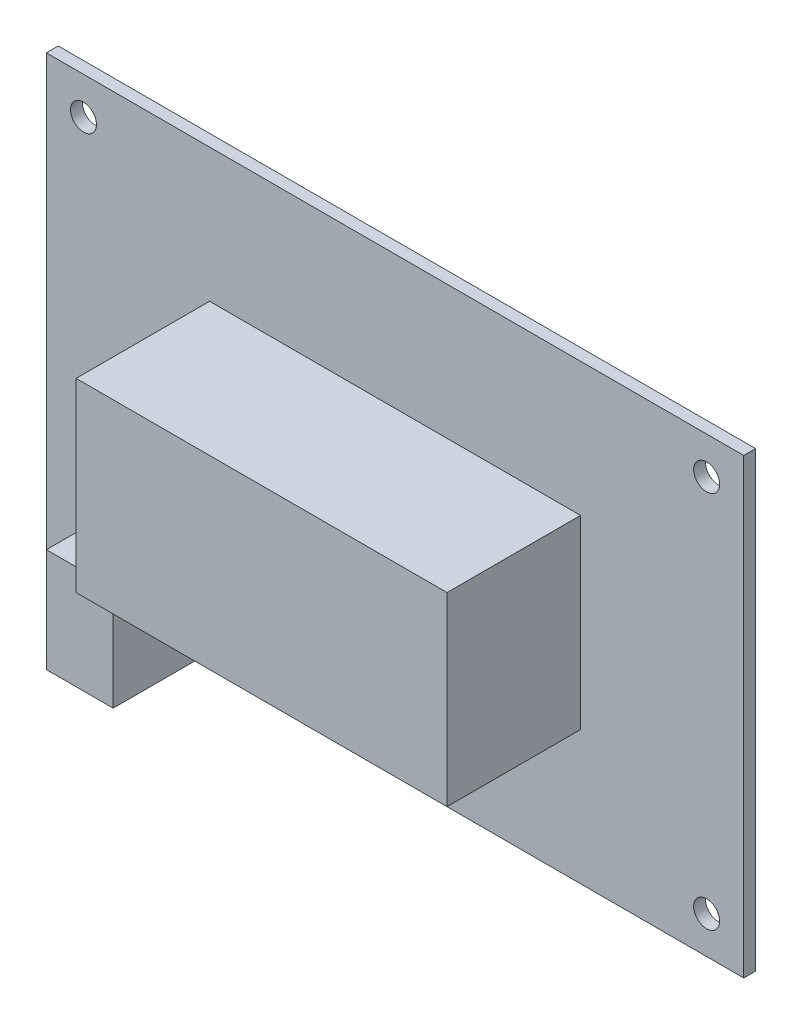
ISO-10303-21;
HEADER;
FILE_DESCRIPTION(('STEP AP214'),'2;1');
FILE_NAME('part.step','',(''),(''),'','','');
FILE_SCHEMA(('AUTOMOTIVE_DESIGN { 1 0 10303 214 1 1 1 1 }'));
ENDSEC;
DATA;
#1=APPLICATION_CONTEXT('core data for automotive mechanical design processes');
#2=APPLICATION_PROTOCOL_DEFINITION('international standard','automotive_design',2000,#1);
#3=PRODUCT_CONTEXT('',#1,'mechanical');
#4=PRODUCT('Part','Part','',(#3));
#5=PRODUCT_RELATED_PRODUCT_CATEGORY('part','',(#4));
#6=PRODUCT_DEFINITION_FORMATION('','',#4);
#7=PRODUCT_DEFINITION_CONTEXT('part definition',#1,'design');
#8=PRODUCT_DEFINITION('design','',#6,#7);
#9=PRODUCT_DEFINITION_SHAPE('','',#8);
#10=(LENGTH_UNIT() NAMED_UNIT(*) SI_UNIT(.MILLI.,.METRE.));
#11=(NAMED_UNIT(*) PLANE_ANGLE_UNIT() SI_UNIT($,.RADIAN.));
#12=(NAMED_UNIT(*) SI_UNIT($,.STERADIAN.) SOLID_ANGLE_UNIT());
#13=UNCERTAINTY_MEASURE_WITH_UNIT(LENGTH_MEASURE(1.E-05),#10,'distance_accuracy_value','');
#14=(GEOMETRIC_REPRESENTATION_CONTEXT(3) GLOBAL_UNCERTAINTY_ASSIGNED_CONTEXT((#13)) GLOBAL_UNIT_ASSIGNED_CONTEXT((#10,
#11,#12)) REPRESENTATION_CONTEXT('',''));
#15=CARTESIAN_POINT('',(0.,0.,0.));
#16=DIRECTION('',(0.,0.,1.));
#17=DIRECTION('',(1.,0.,0.));
#18=AXIS2_PLACEMENT_3D('',#15,#16,#17);
#19=CARTESIAN_POINT('',(0.,0.,1.6));
#20=DIRECTION('',(0.,0.,-1.));
#21=DIRECTION('',(-1.,0.,0.));
#22=AXIS2_PLACEMENT_3D('',#19,#20,#21);
#23=PLANE('',#22);
#24=DIRECTION('',(0.,-1.,0.));
#25=VECTOR('',#24,1.);
#26=CARTESIAN_POINT('',(-25.,12.5,1.6));
#27=LINE('',#26,#25);
#28=CARTESIAN_POINT('',(-25.,12.5,1.6));
#29=VERTEX_POINT('',#28);
#30=CARTESIAN_POINT('',(-25.,-12.5,1.6));
#31=VERTEX_POINT('',#30);
#32=EDGE_CURVE('E143',#29,#31,#27,.T.);
#33=ORIENTED_EDGE('',*,*,#32,.F.);
#34=DIRECTION('',(-1.,0.,0.));
#35=VECTOR('',#34,1.);
#36=CARTESIAN_POINT('',(25.,12.5,1.6));
#37=LINE('',#36,#35);
#38=CARTESIAN_POINT('',(25.,12.5,1.6));
#39=VERTEX_POINT('',#38);
#40=EDGE_CURVE('E156',#39,#29,#37,.T.);
#41=ORIENTED_EDGE('',*,*,#40,.F.);
#42=DIRECTION('',(0.,1.,0.));
#43=VECTOR('',#42,1.);
#44=CARTESIAN_POINT('',(25.,12.5,1.6));
#45=LINE('',#44,#43);
#46=CARTESIAN_POINT('',(25.,-12.5,1.6));
#47=VERTEX_POINT('',#46);
#48=EDGE_CURVE('E165',#47,#39,#45,.T.);
#49=ORIENTED_EDGE('',*,*,#48,.F.);
#50=DIRECTION('',(1.,0.,0.));
#51=VECTOR('',#50,1.);
#52=CARTESIAN_POINT('',(25.,-12.5,1.6));
#53=LINE('',#52,#51);
#54=EDGE_CURVE('E146',#31,#47,#53,.T.);
#55=ORIENTED_EDGE('',*,*,#54,.F.);
#56=EDGE_LOOP('',(#33,#41,#49,#55));
#57=FACE_BOUND('',#56,.T.);
#58=CARTESIAN_POINT('',(-42.,25.5,1.6));
#59=DIRECTION('',(0.,0.,1.));
#60=DIRECTION('',(1.,0.,0.));
#61=AXIS2_PLACEMENT_3D('',#58,#59,#60);
#62=CIRCLE('',#61,1.75);
#63=CARTESIAN_POINT('',(-40.25,25.5,1.6));
#64=VERTEX_POINT('',#63);
#65=EDGE_CURVE('E200',#64,#64,#62,.T.);
#66=ORIENTED_EDGE('',*,*,#65,.F.);
#67=EDGE_LOOP('',(#66));
#68=FACE_BOUND('',#67,.T.);
#69=CARTESIAN_POINT('',(42.,25.5,1.6));
#70=DIRECTION('',(0.,0.,1.));
#71=DIRECTION('',(1.,0.,0.));
#72=AXIS2_PLACEMENT_3D('',#69,#70,#71);
#73=CIRCLE('',#72,1.75);
#74=CARTESIAN_POINT('',(43.75,25.5,1.6));
#75=VERTEX_POINT('',#74);
#76=EDGE_CURVE('E194',#75,#75,#73,.T.);
#77=ORIENTED_EDGE('',*,*,#76,.F.);
#78=EDGE_LOOP('',(#77));
#79=FACE_BOUND('',#78,.T.);
#80=CARTESIAN_POINT('',(42.,-25.5,1.6));
#81=DIRECTION('',(0.,0.,1.));
#82=DIRECTION('',(1.,0.,0.));
#83=AXIS2_PLACEMENT_3D('',#80,#81,#82);
#84=CIRCLE('',#83,1.75);
#85=CARTESIAN_POINT('',(43.75,-25.5,1.6));
#86=VERTEX_POINT('',#85);
#87=EDGE_CURVE('E188',#86,#86,#84,.T.);
#88=ORIENTED_EDGE('',*,*,#87,.F.);
#89=EDGE_LOOP('',(#88));
#90=FACE_BOUND('',#89,.T.);
#91=CARTESIAN_POINT('',(-42.,-25.5,1.6));
#92=DIRECTION('',(0.,0.,1.));
#93=DIRECTION('',(1.,0.,0.));
#94=AXIS2_PLACEMENT_3D('',#91,#92,#93);
#95=CIRCLE('',#94,1.75);
#96=CARTESIAN_POINT('',(-40.25,-25.5,1.6));
#97=VERTEX_POINT('',#96);
#98=EDGE_CURVE('E182',#97,#97,#95,.T.);
#99=ORIENTED_EDGE('',*,*,#98,.F.);
#100=EDGE_LOOP('',(#99));
#101=FACE_BOUND('',#100,.T.);
#102=DIRECTION('',(0.,-1.,0.));
#103=VECTOR('',#102,1.);
#104=CARTESIAN_POINT('',(-36.,-30.5,1.6));
#105=LINE('',#104,#103);
#106=CARTESIAN_POINT('',(-36.,-16.5,1.6));
#107=VERTEX_POINT('',#106);
#108=CARTESIAN_POINT('',(-36.,-30.5,1.6));
#109=VERTEX_POINT('',#108);
#110=EDGE_CURVE('E49',#107,#109,#105,.T.);
#111=ORIENTED_EDGE('',*,*,#110,.F.);
#112=DIRECTION('',(-1.,0.,0.));
#113=VECTOR('',#112,1.);
#114=CARTESIAN_POINT('',(-36.,-16.5,1.6));
#115=LINE('',#114,#113);
#116=CARTESIAN_POINT('',(-27.,-16.5,1.6));
#117=VERTEX_POINT('',#116);
#118=EDGE_CURVE('E53',#117,#107,#115,.T.);
#119=ORIENTED_EDGE('',*,*,#118,.F.);
#120=DIRECTION('',(0.,1.,0.));
#121=VECTOR('',#120,1.);
#122=CARTESIAN_POINT('',(-27.,-30.5,1.6));
#123=LINE('',#122,#121);
#124=CARTESIAN_POINT('',(-27.,-30.5,1.6));
#125=VERTEX_POINT('',#124);
#126=EDGE_CURVE('E248',#125,#117,#123,.T.);
#127=ORIENTED_EDGE('',*,*,#126,.F.);
#128=DIRECTION('',(1.,0.,0.));
#129=VECTOR('',#128,1.);
#130=CARTESIAN_POINT('',(47.,-30.5,1.6));
#131=LINE('',#130,#129);
#132=CARTESIAN_POINT('',(47.,-30.5,1.6));
#133=VERTEX_POINT('',#132);
#134=EDGE_CURVE('E209',#125,#133,#131,.T.);
#135=ORIENTED_EDGE('',*,*,#134,.T.);
#136=DIRECTION('',(0.,1.,0.));
#137=VECTOR('',#136,1.);
#138=CARTESIAN_POINT('',(47.,30.5,1.6));
#139=LINE('',#138,#137);
#140=CARTESIAN_POINT('',(47.,30.5,1.6));
#141=VERTEX_POINT('',#140);
#142=EDGE_CURVE('E213',#133,#141,#139,.T.);
#143=ORIENTED_EDGE('',*,*,#142,.T.);
#144=DIRECTION('',(-1.,0.,0.));
#145=VECTOR('',#144,1.);
#146=CARTESIAN_POINT('',(47.,30.5,1.6));
#147=LINE('',#146,#145);
#148=CARTESIAN_POINT('',(-47.,30.5,1.6));
#149=VERTEX_POINT('',#148);
#150=EDGE_CURVE('E215',#141,#149,#147,.T.);
#151=ORIENTED_EDGE('',*,*,#150,.T.);
#152=DIRECTION('',(0.,-1.,0.));
#153=VECTOR('',#152,1.);
#154=CARTESIAN_POINT('',(-47.,30.5,1.6));
#155=LINE('',#154,#153);
#156=CARTESIAN_POINT('',(-47.,-30.5,1.6));
#157=VERTEX_POINT('',#156);
#158=EDGE_CURVE('E206',#149,#157,#155,.T.);
#159=ORIENTED_EDGE('',*,*,#158,.T.);
#160=EDGE_CURVE('E211',#157,#109,#131,.T.);
#161=ORIENTED_EDGE('',*,*,#160,.T.);
#162=EDGE_LOOP('',(#111,#119,#127,#135,#143,#151,#159,#161));
#163=FACE_BOUND('',#162,.T.);
#164=ADVANCED_FACE('F34',(#57,#68,#79,#90,#101,#163),#23,.F.);
#165=CARTESIAN_POINT('',(0.,0.,0.));
#166=DIRECTION('',(0.,0.,-1.));
#167=DIRECTION('',(-1.,0.,0.));
#168=AXIS2_PLACEMENT_3D('',#165,#166,#167);
#169=PLANE('',#168);
#170=CARTESIAN_POINT('',(42.,-25.5,0.));
#171=DIRECTION('',(0.,0.,1.));
#172=DIRECTION('',(1.,0.,0.));
#173=AXIS2_PLACEMENT_3D('',#170,#171,#172);
#174=CIRCLE('',#173,1.75);
#175=CARTESIAN_POINT('',(43.75,-25.5,0.));
#176=VERTEX_POINT('',#175);
#177=EDGE_CURVE('E185',#176,#176,#174,.T.);
#178=ORIENTED_EDGE('',*,*,#177,.T.);
#179=EDGE_LOOP('',(#178));
#180=FACE_BOUND('',#179,.T.);
#181=CARTESIAN_POINT('',(-42.,25.5,0.));
#182=DIRECTION('',(0.,0.,1.));
#183=DIRECTION('',(1.,0.,0.));
#184=AXIS2_PLACEMENT_3D('',#181,#182,#183);
#185=CIRCLE('',#184,1.75);
#186=CARTESIAN_POINT('',(-40.25,25.5,0.));
#187=VERTEX_POINT('',#186);
#188=EDGE_CURVE('E197',#187,#187,#185,.T.);
#189=ORIENTED_EDGE('',*,*,#188,.T.);
#190=EDGE_LOOP('',(#189));
#191=FACE_BOUND('',#190,.T.);
#192=DIRECTION('',(0.,-1.,0.));
#193=VECTOR('',#192,1.);
#194=CARTESIAN_POINT('',(-47.,30.5,0.));
#195=LINE('',#194,#193);
#196=CARTESIAN_POINT('',(-47.,30.5,0.));
#197=VERTEX_POINT('',#196);
#198=CARTESIAN_POINT('',(-47.,-30.5,0.));
#199=VERTEX_POINT('',#198);
#200=EDGE_CURVE('E203',#197,#199,#195,.T.);
#201=ORIENTED_EDGE('',*,*,#200,.F.);
#202=DIRECTION('',(-1.,0.,0.));
#203=VECTOR('',#202,1.);
#204=CARTESIAN_POINT('',(47.,30.5,0.));
#205=LINE('',#204,#203);
#206=CARTESIAN_POINT('',(47.,30.5,0.));
#207=VERTEX_POINT('',#206);
#208=EDGE_CURVE('E210',#207,#197,#205,.T.);
#209=ORIENTED_EDGE('',*,*,#208,.F.);
#210=DIRECTION('',(0.,1.,0.));
#211=VECTOR('',#210,1.);
#212=CARTESIAN_POINT('',(47.,30.5,0.));
#213=LINE('',#212,#211);
#214=CARTESIAN_POINT('',(47.,-30.5,0.));
#215=VERTEX_POINT('',#214);
#216=EDGE_CURVE('E222',#215,#207,#213,.T.);
#217=ORIENTED_EDGE('',*,*,#216,.F.);
#218=DIRECTION('',(1.,0.,0.));
#219=VECTOR('',#218,1.);
#220=CARTESIAN_POINT('',(47.,-30.5,0.));
#221=LINE('',#220,#219);
#222=EDGE_CURVE('E220',#199,#215,#221,.T.);
#223=ORIENTED_EDGE('',*,*,#222,.F.);
#224=EDGE_LOOP('',(#201,#209,#217,#223));
#225=FACE_BOUND('',#224,.T.);
#226=CARTESIAN_POINT('',(42.,25.5,0.));
#227=DIRECTION('',(0.,0.,1.));
#228=DIRECTION('',(1.,0.,0.));
#229=AXIS2_PLACEMENT_3D('',#226,#227,#228);
#230=CIRCLE('',#229,1.75);
#231=CARTESIAN_POINT('',(43.75,25.5,0.));
#232=VERTEX_POINT('',#231);
#233=EDGE_CURVE('E191',#232,#232,#230,.T.);
#234=ORIENTED_EDGE('',*,*,#233,.T.);
#235=EDGE_LOOP('',(#234));
#236=FACE_BOUND('',#235,.T.);
#237=CARTESIAN_POINT('',(-42.,-25.5,0.));
#238=DIRECTION('',(0.,0.,1.));
#239=DIRECTION('',(1.,0.,0.));
#240=AXIS2_PLACEMENT_3D('',#237,#238,#239);
#241=CIRCLE('',#240,1.75);
#242=CARTESIAN_POINT('',(-40.25,-25.5,0.));
#243=VERTEX_POINT('',#242);
#244=EDGE_CURVE('E181',#243,#243,#241,.T.);
#245=ORIENTED_EDGE('',*,*,#244,.T.);
#246=EDGE_LOOP('',(#245));
#247=FACE_BOUND('',#246,.T.);
#248=ADVANCED_FACE('F239',(#180,#191,#225,#236,#247),#169,.T.);
#249=CARTESIAN_POINT('',(-47.,30.5,1.6));
#250=DIRECTION('',(1.,0.,0.));
#251=DIRECTION('',(0.,0.,-1.));
#252=AXIS2_PLACEMENT_3D('',#249,#250,#251);
#253=PLANE('',#252);
#254=ORIENTED_EDGE('',*,*,#200,.T.);
#255=DIRECTION('',(0.,0.,-1.));
#256=VECTOR('',#255,1.);
#257=CARTESIAN_POINT('',(-47.,-30.5,1.6));
#258=LINE('',#257,#256);
#259=EDGE_CURVE('E11',#157,#199,#258,.T.);
#260=ORIENTED_EDGE('',*,*,#259,.F.);
#261=ORIENTED_EDGE('',*,*,#158,.F.);
#262=DIRECTION('',(0.,0.,-1.));
#263=VECTOR('',#262,1.);
#264=CARTESIAN_POINT('',(-47.,30.5,1.6));
#265=LINE('',#264,#263);
#266=EDGE_CURVE('E217',#149,#197,#265,.T.);
#267=ORIENTED_EDGE('',*,*,#266,.T.);
#268=EDGE_LOOP('',(#254,#260,#261,#267));
#269=FACE_BOUND('',#268,.T.);
#270=ADVANCED_FACE('F36',(#269),#253,.F.);
#271=CARTESIAN_POINT('',(47.,-30.5,1.6));
#272=DIRECTION('',(0.,1.,0.));
#273=DIRECTION('',(-1.,0.,0.));
#274=AXIS2_PLACEMENT_3D('',#271,#272,#273);
#275=PLANE('',#274);
#276=ORIENTED_EDGE('',*,*,#222,.T.);
#277=DIRECTION('',(0.,0.,-1.));
#278=VECTOR('',#277,1.);
#279=CARTESIAN_POINT('',(47.,-30.5,1.6));
#280=LINE('',#279,#278);
#281=EDGE_CURVE('E42',#133,#215,#280,.T.);
#282=ORIENTED_EDGE('',*,*,#281,.F.);
#283=ORIENTED_EDGE('',*,*,#134,.F.);
#284=DIRECTION('',(0.,0.,-1.));
#285=VECTOR('',#284,1.);
#286=CARTESIAN_POINT('',(-27.,-30.5,12.6));
#287=LINE('',#286,#285);
#288=CARTESIAN_POINT('',(-27.,-30.5,12.6));
#289=VERTEX_POINT('',#288);
#290=EDGE_CURVE('E128',#289,#125,#287,.T.);
#291=ORIENTED_EDGE('',*,*,#290,.F.);
#292=DIRECTION('',(1.,0.,0.));
#293=VECTOR('',#292,1.);
#294=CARTESIAN_POINT('',(-36.,-30.5,12.6));
#295=LINE('',#294,#293);
#296=CARTESIAN_POINT('',(-36.,-30.5,12.6));
#297=VERTEX_POINT('',#296);
#298=EDGE_CURVE('E122',#297,#289,#295,.T.);
#299=ORIENTED_EDGE('',*,*,#298,.F.);
#300=DIRECTION('',(0.,0.,-1.));
#301=VECTOR('',#300,1.);
#302=CARTESIAN_POINT('',(-36.,-30.5,12.6));
#303=LINE('',#302,#301);
#304=EDGE_CURVE('E126',#297,#109,#303,.T.);
#305=ORIENTED_EDGE('',*,*,#304,.T.);
#306=ORIENTED_EDGE('',*,*,#160,.F.);
#307=ORIENTED_EDGE('',*,*,#259,.T.);
#308=EDGE_LOOP('',(#276,#282,#283,#291,#299,#305,#306,#307));
#309=FACE_BOUND('',#308,.T.);
#310=ADVANCED_FACE('F124',(#309),#275,.F.);
#311=CARTESIAN_POINT('',(47.,30.5,1.6));
#312=DIRECTION('',(-1.,0.,0.));
#313=DIRECTION('',(0.,-1.,0.));
#314=AXIS2_PLACEMENT_3D('',#311,#312,#313);
#315=PLANE('',#314);
#316=ORIENTED_EDGE('',*,*,#216,.T.);
#317=DIRECTION('',(0.,0.,-1.));
#318=VECTOR('',#317,1.);
#319=CARTESIAN_POINT('',(47.,30.5,1.6));
#320=LINE('',#319,#318);
#321=EDGE_CURVE('E227',#141,#207,#320,.T.);
#322=ORIENTED_EDGE('',*,*,#321,.F.);
#323=ORIENTED_EDGE('',*,*,#142,.F.);
#324=ORIENTED_EDGE('',*,*,#281,.T.);
#325=EDGE_LOOP('',(#316,#322,#323,#324));
#326=FACE_BOUND('',#325,.T.);
#327=ADVANCED_FACE('F234',(#326),#315,.F.);
#328=CARTESIAN_POINT('',(47.,30.5,1.6));
#329=DIRECTION('',(0.,-1.,0.));
#330=DIRECTION('',(1.,0.,0.));
#331=AXIS2_PLACEMENT_3D('',#328,#329,#330);
#332=PLANE('',#331);
#333=ORIENTED_EDGE('',*,*,#208,.T.);
#334=ORIENTED_EDGE('',*,*,#266,.F.);
#335=ORIENTED_EDGE('',*,*,#150,.F.);
#336=ORIENTED_EDGE('',*,*,#321,.T.);
#337=EDGE_LOOP('',(#333,#334,#335,#336));
#338=FACE_BOUND('',#337,.T.);
#339=ADVANCED_FACE('F243',(#338),#332,.F.);
#340=CARTESIAN_POINT('',(-42.,25.5,1.6));
#341=DIRECTION('',(0.,0.,-1.));
#342=DIRECTION('',(-1.,0.,0.));
#343=AXIS2_PLACEMENT_3D('',#340,#341,#342);
#344=CYLINDRICAL_SURFACE('',#343,1.75);
#345=ORIENTED_EDGE('',*,*,#65,.T.);
#346=EDGE_LOOP('',(#345));
#347=FACE_BOUND('',#346,.T.);
#348=ORIENTED_EDGE('',*,*,#188,.F.);
#349=EDGE_LOOP('',(#348));
#350=FACE_BOUND('',#349,.T.);
#351=ADVANCED_FACE('F280',(#347,#350),#344,.F.);
#352=CARTESIAN_POINT('',(42.,25.5,1.6));
#353=DIRECTION('',(0.,0.,-1.));
#354=DIRECTION('',(-1.,0.,0.));
#355=AXIS2_PLACEMENT_3D('',#352,#353,#354);
#356=CYLINDRICAL_SURFACE('',#355,1.75);
#357=ORIENTED_EDGE('',*,*,#76,.T.);
#358=EDGE_LOOP('',(#357));
#359=FACE_BOUND('',#358,.T.);
#360=ORIENTED_EDGE('',*,*,#233,.F.);
#361=EDGE_LOOP('',(#360));
#362=FACE_BOUND('',#361,.T.);
#363=ADVANCED_FACE('F326',(#359,#362),#356,.F.);
#364=CARTESIAN_POINT('',(42.,-25.5,1.6));
#365=DIRECTION('',(0.,0.,-1.));
#366=DIRECTION('',(-1.,0.,0.));
#367=AXIS2_PLACEMENT_3D('',#364,#365,#366);
#368=CYLINDRICAL_SURFACE('',#367,1.75);
#369=ORIENTED_EDGE('',*,*,#87,.T.);
#370=EDGE_LOOP('',(#369));
#371=FACE_BOUND('',#370,.T.);
#372=ORIENTED_EDGE('',*,*,#177,.F.);
#373=EDGE_LOOP('',(#372));
#374=FACE_BOUND('',#373,.T.);
#375=ADVANCED_FACE('F334',(#371,#374),#368,.F.);
#376=CARTESIAN_POINT('',(-42.,-25.5,1.6));
#377=DIRECTION('',(0.,0.,-1.));
#378=DIRECTION('',(-1.,0.,0.));
#379=AXIS2_PLACEMENT_3D('',#376,#377,#378);
#380=CYLINDRICAL_SURFACE('',#379,1.75);
#381=ORIENTED_EDGE('',*,*,#98,.T.);
#382=EDGE_LOOP('',(#381));
#383=FACE_BOUND('',#382,.T.);
#384=ORIENTED_EDGE('',*,*,#244,.F.);
#385=EDGE_LOOP('',(#384));
#386=FACE_BOUND('',#385,.T.);
#387=ADVANCED_FACE('F342',(#383,#386),#380,.F.);
#388=CARTESIAN_POINT('',(-25.,12.5,19.6));
#389=DIRECTION('',(1.,0.,0.));
#390=DIRECTION('',(0.,1.,0.));
#391=AXIS2_PLACEMENT_3D('',#388,#389,#390);
#392=PLANE('',#391);
#393=ORIENTED_EDGE('',*,*,#32,.T.);
#394=DIRECTION('',(0.,0.,-1.));
#395=VECTOR('',#394,1.);
#396=CARTESIAN_POINT('',(-25.,-12.5,19.6));
#397=LINE('',#396,#395);
#398=CARTESIAN_POINT('',(-25.,-12.5,19.6));
#399=VERTEX_POINT('',#398);
#400=EDGE_CURVE('E178',#399,#31,#397,.T.);
#401=ORIENTED_EDGE('',*,*,#400,.F.);
#402=DIRECTION('',(0.,-1.,0.));
#403=VECTOR('',#402,1.);
#404=CARTESIAN_POINT('',(-25.,12.5,19.6));
#405=LINE('',#404,#403);
#406=CARTESIAN_POINT('',(-25.,12.5,19.6));
#407=VERTEX_POINT('',#406);
#408=EDGE_CURVE('E152',#407,#399,#405,.T.);
#409=ORIENTED_EDGE('',*,*,#408,.F.);
#410=DIRECTION('',(0.,0.,-1.));
#411=VECTOR('',#410,1.);
#412=CARTESIAN_POINT('',(-25.,12.5,19.6));
#413=LINE('',#412,#411);
#414=EDGE_CURVE('E161',#407,#29,#413,.T.);
#415=ORIENTED_EDGE('',*,*,#414,.T.);
#416=EDGE_LOOP('',(#393,#401,#409,#415));
#417=FACE_BOUND('',#416,.T.);
#418=ADVANCED_FACE('F351',(#417),#392,.F.);
#419=CARTESIAN_POINT('',(25.,-12.5,19.6));
#420=DIRECTION('',(0.,1.,0.));
#421=DIRECTION('',(-1.,0.,0.));
#422=AXIS2_PLACEMENT_3D('',#419,#420,#421);
#423=PLANE('',#422);
#424=ORIENTED_EDGE('',*,*,#54,.T.);
#425=DIRECTION('',(0.,0.,-1.));
#426=VECTOR('',#425,1.);
#427=CARTESIAN_POINT('',(25.,-12.5,19.6));
#428=LINE('',#427,#426);
#429=CARTESIAN_POINT('',(25.,-12.5,19.6));
#430=VERTEX_POINT('',#429);
#431=EDGE_CURVE('E175',#430,#47,#428,.T.);
#432=ORIENTED_EDGE('',*,*,#431,.F.);
#433=DIRECTION('',(1.,0.,0.));
#434=VECTOR('',#433,1.);
#435=CARTESIAN_POINT('',(25.,-12.5,19.6));
#436=LINE('',#435,#434);
#437=EDGE_CURVE('E155',#399,#430,#436,.T.);
#438=ORIENTED_EDGE('',*,*,#437,.F.);
#439=ORIENTED_EDGE('',*,*,#400,.T.);
#440=EDGE_LOOP('',(#424,#432,#438,#439));
#441=FACE_BOUND('',#440,.T.);
#442=ADVANCED_FACE('F360',(#441),#423,.F.);
#443=CARTESIAN_POINT('',(25.,12.5,19.6));
#444=DIRECTION('',(-1.,0.,0.));
#445=DIRECTION('',(0.,-1.,0.));
#446=AXIS2_PLACEMENT_3D('',#443,#444,#445);
#447=PLANE('',#446);
#448=ORIENTED_EDGE('',*,*,#48,.T.);
#449=DIRECTION('',(0.,0.,-1.));
#450=VECTOR('',#449,1.);
#451=CARTESIAN_POINT('',(25.,12.5,19.6));
#452=LINE('',#451,#450);
#453=CARTESIAN_POINT('',(25.,12.5,19.6));
#454=VERTEX_POINT('',#453);
#455=EDGE_CURVE('E172',#454,#39,#452,.T.);
#456=ORIENTED_EDGE('',*,*,#455,.F.);
#457=DIRECTION('',(0.,1.,0.));
#458=VECTOR('',#457,1.);
#459=CARTESIAN_POINT('',(25.,12.5,19.6));
#460=LINE('',#459,#458);
#461=EDGE_CURVE('E158',#430,#454,#460,.T.);
#462=ORIENTED_EDGE('',*,*,#461,.F.);
#463=ORIENTED_EDGE('',*,*,#431,.T.);
#464=EDGE_LOOP('',(#448,#456,#462,#463));
#465=FACE_BOUND('',#464,.T.);
#466=ADVANCED_FACE('F369',(#465),#447,.F.);
#467=CARTESIAN_POINT('',(25.,12.5,19.6));
#468=DIRECTION('',(0.,-1.,0.));
#469=DIRECTION('',(1.,0.,0.));
#470=AXIS2_PLACEMENT_3D('',#467,#468,#469);
#471=PLANE('',#470);
#472=ORIENTED_EDGE('',*,*,#40,.T.);
#473=ORIENTED_EDGE('',*,*,#414,.F.);
#474=DIRECTION('',(-1.,0.,0.));
#475=VECTOR('',#474,1.);
#476=CARTESIAN_POINT('',(25.,12.5,19.6));
#477=LINE('',#476,#475);
#478=EDGE_CURVE('E160',#454,#407,#477,.T.);
#479=ORIENTED_EDGE('',*,*,#478,.F.);
#480=ORIENTED_EDGE('',*,*,#455,.T.);
#481=EDGE_LOOP('',(#472,#473,#479,#480));
#482=FACE_BOUND('',#481,.T.);
#483=ADVANCED_FACE('F378',(#482),#471,.F.);
#484=CARTESIAN_POINT('',(0.,0.,19.6));
#485=DIRECTION('',(0.,0.,-1.));
#486=DIRECTION('',(-1.,0.,0.));
#487=AXIS2_PLACEMENT_3D('',#484,#485,#486);
#488=PLANE('',#487);
#489=ORIENTED_EDGE('',*,*,#408,.T.);
#490=ORIENTED_EDGE('',*,*,#437,.T.);
#491=ORIENTED_EDGE('',*,*,#461,.T.);
#492=ORIENTED_EDGE('',*,*,#478,.T.);
#493=EDGE_LOOP('',(#489,#490,#491,#492));
#494=FACE_BOUND('',#493,.T.);
#495=ADVANCED_FACE('F387',(#494),#488,.F.);
#496=CARTESIAN_POINT('',(-36.,-30.5,12.6));
#497=DIRECTION('',(1.,0.,0.));
#498=DIRECTION('',(0.,0.,-1.));
#499=AXIS2_PLACEMENT_3D('',#496,#497,#498);
#500=PLANE('',#499);
#501=ORIENTED_EDGE('',*,*,#110,.T.);
#502=ORIENTED_EDGE('',*,*,#304,.F.);
#503=DIRECTION('',(0.,-1.,0.));
#504=VECTOR('',#503,1.);
#505=CARTESIAN_POINT('',(-36.,-30.5,12.6));
#506=LINE('',#505,#504);
#507=CARTESIAN_POINT('',(-36.,-16.5,12.6));
#508=VERTEX_POINT('',#507);
#509=EDGE_CURVE('E132',#508,#297,#506,.T.);
#510=ORIENTED_EDGE('',*,*,#509,.F.);
#511=DIRECTION('',(0.,0.,-1.));
#512=VECTOR('',#511,1.);
#513=CARTESIAN_POINT('',(-36.,-16.5,12.6));
#514=LINE('',#513,#512);
#515=EDGE_CURVE('E255',#508,#107,#514,.T.);
#516=ORIENTED_EDGE('',*,*,#515,.T.);
#517=EDGE_LOOP('',(#501,#502,#510,#516));
#518=FACE_BOUND('',#517,.T.);
#519=ADVANCED_FACE('F142',(#518),#500,.F.);
#520=CARTESIAN_POINT('',(-27.,-30.5,12.6));
#521=DIRECTION('',(-1.,0.,0.));
#522=DIRECTION('',(0.,0.,1.));
#523=AXIS2_PLACEMENT_3D('',#520,#521,#522);
#524=PLANE('',#523);
#525=ORIENTED_EDGE('',*,*,#126,.T.);
#526=DIRECTION('',(0.,0.,-1.));
#527=VECTOR('',#526,1.);
#528=CARTESIAN_POINT('',(-27.,-16.5,12.6));
#529=LINE('',#528,#527);
#530=CARTESIAN_POINT('',(-27.,-16.5,12.6));
#531=VERTEX_POINT('',#530);
#532=EDGE_CURVE('E148',#531,#117,#529,.T.);
#533=ORIENTED_EDGE('',*,*,#532,.F.);
#534=DIRECTION('',(0.,1.,0.));
#535=VECTOR('',#534,1.);
#536=CARTESIAN_POINT('',(-27.,-30.5,12.6));
#537=LINE('',#536,#535);
#538=EDGE_CURVE('E131',#289,#531,#537,.T.);
#539=ORIENTED_EDGE('',*,*,#538,.F.);
#540=ORIENTED_EDGE('',*,*,#290,.T.);
#541=EDGE_LOOP('',(#525,#533,#539,#540));
#542=FACE_BOUND('',#541,.T.);
#543=ADVANCED_FACE('F253',(#542),#524,.F.);
#544=CARTESIAN_POINT('',(-36.,-16.5,12.6));
#545=DIRECTION('',(0.,-1.,0.));
#546=DIRECTION('',(0.,0.,-1.));
#547=AXIS2_PLACEMENT_3D('',#544,#545,#546);
#548=PLANE('',#547);
#549=ORIENTED_EDGE('',*,*,#118,.T.);
#550=ORIENTED_EDGE('',*,*,#515,.F.);
#551=DIRECTION('',(-1.,0.,0.));
#552=VECTOR('',#551,1.);
#553=CARTESIAN_POINT('',(-36.,-16.5,12.6));
#554=LINE('',#553,#552);
#555=EDGE_CURVE('E137',#531,#508,#554,.T.);
#556=ORIENTED_EDGE('',*,*,#555,.F.);
#557=ORIENTED_EDGE('',*,*,#532,.T.);
#558=EDGE_LOOP('',(#549,#550,#556,#557));
#559=FACE_BOUND('',#558,.T.);
#560=ADVANCED_FACE('F261',(#559),#548,.F.);
#561=CARTESIAN_POINT('',(0.,0.,12.6));
#562=DIRECTION('',(0.,0.,-1.));
#563=DIRECTION('',(-1.,0.,0.));
#564=AXIS2_PLACEMENT_3D('',#561,#562,#563);
#565=PLANE('',#564);
#566=ORIENTED_EDGE('',*,*,#509,.T.);
#567=ORIENTED_EDGE('',*,*,#298,.T.);
#568=ORIENTED_EDGE('',*,*,#538,.T.);
#569=ORIENTED_EDGE('',*,*,#555,.T.);
#570=EDGE_LOOP('',(#566,#567,#568,#569));
#571=FACE_BOUND('',#570,.T.);
#572=ADVANCED_FACE('F135',(#571),#565,.F.);
#573=CLOSED_SHELL('',(#164,#248,#270,#310,#327,#339,#351,#363,#375,#387,#418,#442,#466,#483,
#495,#519,#543,#560,#572));
#574=MANIFOLD_SOLID_BREP('B2',#573);
#575=ADVANCED_BREP_SHAPE_REPRESENTATION('',(#18,#574),#14);
#576=SHAPE_DEFINITION_REPRESENTATION(#9,#575);
ENDSEC;
END-ISO-10303-21;
